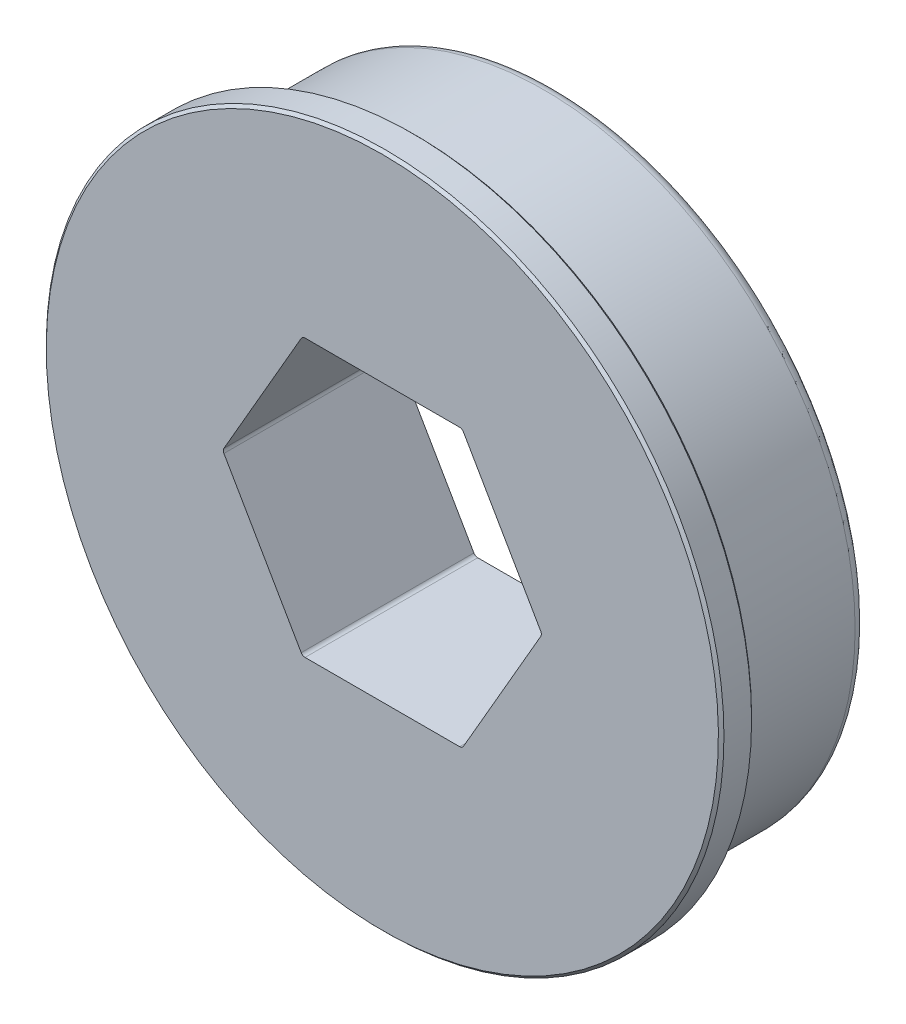
ISO-10303-21;
HEADER;
FILE_DESCRIPTION(('STEP AP214'),'2;1');
FILE_NAME('part.step','',(''),(''),'','','');
FILE_SCHEMA(('AUTOMOTIVE_DESIGN { 1 0 10303 214 1 1 1 1 }'));
ENDSEC;
DATA;
#1=APPLICATION_CONTEXT('core data for automotive mechanical design processes');
#2=APPLICATION_PROTOCOL_DEFINITION('international standard','automotive_design',2000,#1);
#3=PRODUCT_CONTEXT('',#1,'mechanical');
#4=PRODUCT('Part','Part','',(#3));
#5=PRODUCT_RELATED_PRODUCT_CATEGORY('part','',(#4));
#6=PRODUCT_DEFINITION_FORMATION('','',#4);
#7=PRODUCT_DEFINITION_CONTEXT('part definition',#1,'design');
#8=PRODUCT_DEFINITION('design','',#6,#7);
#9=PRODUCT_DEFINITION_SHAPE('','',#8);
#10=(LENGTH_UNIT() NAMED_UNIT(*) SI_UNIT(.MILLI.,.METRE.));
#11=(NAMED_UNIT(*) PLANE_ANGLE_UNIT() SI_UNIT($,.RADIAN.));
#12=(NAMED_UNIT(*) SI_UNIT($,.STERADIAN.) SOLID_ANGLE_UNIT());
#13=UNCERTAINTY_MEASURE_WITH_UNIT(LENGTH_MEASURE(1.E-05),#10,'distance_accuracy_value','');
#14=(GEOMETRIC_REPRESENTATION_CONTEXT(3) GLOBAL_UNCERTAINTY_ASSIGNED_CONTEXT((#13)) GLOBAL_UNIT_ASSIGNED_CONTEXT((#10,
#11,#12)) REPRESENTATION_CONTEXT('',''));
#15=CARTESIAN_POINT('',(0.,0.,0.));
#16=DIRECTION('',(0.,0.,1.));
#17=DIRECTION('',(1.,0.,0.));
#18=AXIS2_PLACEMENT_3D('',#15,#16,#17);
#19=CARTESIAN_POINT('',(0.,0.,7.92734));
#20=DIRECTION('',(0.,0.,-1.));
#21=DIRECTION('',(-1.,0.,0.));
#22=AXIS2_PLACEMENT_3D('',#19,#20,#21);
#23=CYLINDRICAL_SURFACE('',#22,13.97);
#24=CARTESIAN_POINT('',(0.,0.,5.89534000034));
#25=DIRECTION('',(0.,0.,-1.));
#26=DIRECTION('',(-1.,0.,0.));
#27=AXIS2_PLACEMENT_3D('',#24,#25,#26);
#28=CIRCLE('',#27,13.97);
#29=CARTESIAN_POINT('',(-13.97,0.,5.89534000034));
#30=VERTEX_POINT('',#29);
#31=EDGE_CURVE('E255',#30,#30,#28,.T.);
#32=ORIENTED_EDGE('',*,*,#31,.F.);
#33=EDGE_LOOP('',(#32));
#34=FACE_BOUND('',#33,.T.);
#35=CARTESIAN_POINT('',(0.,0.,6.40333999979));
#36=DIRECTION('',(0.,0.,-1.));
#37=DIRECTION('',(-1.,0.,0.));
#38=AXIS2_PLACEMENT_3D('',#35,#36,#37);
#39=CIRCLE('',#38,13.97);
#40=CARTESIAN_POINT('',(-13.97,0.,6.40333999979));
#41=VERTEX_POINT('',#40);
#42=EDGE_CURVE('E252',#41,#41,#39,.F.);
#43=ORIENTED_EDGE('',*,*,#42,.F.);
#44=EDGE_LOOP('',(#43));
#45=FACE_BOUND('',#44,.T.);
#46=ADVANCED_FACE('F17',(#34,#45),#23,.T.);
#47=CARTESIAN_POINT('',(14.2875,0.,5.89534));
#48=DIRECTION('',(0.,0.,1.));
#49=DIRECTION('',(1.,0.,0.));
#50=AXIS2_PLACEMENT_3D('',#47,#48,#49);
#51=PLANE('',#50);
#52=ORIENTED_EDGE('',*,*,#31,.T.);
#53=EDGE_LOOP('',(#52));
#54=FACE_BOUND('',#53,.T.);
#55=CARTESIAN_POINT('',(0.,0.,5.89534000034));
#56=DIRECTION('',(0.,0.,-1.));
#57=DIRECTION('',(-1.,0.,0.));
#58=AXIS2_PLACEMENT_3D('',#55,#56,#57);
#59=CIRCLE('',#58,14.2875);
#60=CARTESIAN_POINT('',(-14.2875,0.,5.89534000034));
#61=VERTEX_POINT('',#60);
#62=EDGE_CURVE('E249',#61,#61,#59,.T.);
#63=ORIENTED_EDGE('',*,*,#62,.F.);
#64=EDGE_LOOP('',(#63));
#65=FACE_BOUND('',#64,.T.);
#66=ADVANCED_FACE('F378',(#54,#65),#51,.T.);
#67=CARTESIAN_POINT('',(13.97,0.,6.40334));
#68=DIRECTION('',(0.,0.,-1.));
#69=DIRECTION('',(-1.,0.,0.));
#70=AXIS2_PLACEMENT_3D('',#67,#68,#69);
#71=PLANE('',#70);
#72=ORIENTED_EDGE('',*,*,#42,.T.);
#73=EDGE_LOOP('',(#72));
#74=FACE_BOUND('',#73,.T.);
#75=CARTESIAN_POINT('',(0.,0.,6.40333999975));
#76=DIRECTION('',(0.,0.,1.));
#77=DIRECTION('',(1.,0.,0.));
#78=AXIS2_PLACEMENT_3D('',#75,#76,#77);
#79=CIRCLE('',#78,15.43049999975);
#80=CARTESIAN_POINT('',(15.43049999975,0.,6.40333999975));
#81=VERTEX_POINT('',#80);
#82=EDGE_CURVE('E220',#81,#81,#79,.T.);
#83=ORIENTED_EDGE('',*,*,#82,.F.);
#84=EDGE_LOOP('',(#83));
#85=FACE_BOUND('',#84,.T.);
#86=ADVANCED_FACE('F373',(#74,#85),#71,.T.);
#87=CARTESIAN_POINT('',(0.,0.,7.92734));
#88=DIRECTION('',(0.,0.,-1.));
#89=DIRECTION('',(-1.,0.,0.));
#90=AXIS2_PLACEMENT_3D('',#87,#88,#89);
#91=CYLINDRICAL_SURFACE('',#90,14.2875);
#92=ORIENTED_EDGE('',*,*,#62,.T.);
#93=EDGE_LOOP('',(#92));
#94=FACE_BOUND('',#93,.T.);
#95=CARTESIAN_POINT('',(0.,0.,0.508));
#96=DIRECTION('',(0.,0.,-1.));
#97=DIRECTION('',(1.,0.,0.));
#98=AXIS2_PLACEMENT_3D('',#95,#96,#97);
#99=CIRCLE('',#98,14.2875);
#100=CARTESIAN_POINT('',(14.2875,0.,0.508));
#101=VERTEX_POINT('',#100);
#102=EDGE_CURVE('E218',#101,#101,#99,.T.);
#103=ORIENTED_EDGE('',*,*,#102,.F.);
#104=EDGE_LOOP('',(#103));
#105=FACE_BOUND('',#104,.T.);
#106=ADVANCED_FACE('F368',(#94,#105),#91,.T.);
#107=CARTESIAN_POINT('',(0.,0.,6.53034000006006));
#108=DIRECTION('',(0.,0.,1.));
#109=DIRECTION('',(1.,0.,0.));
#110=AXIS2_PLACEMENT_3D('',#107,#108,#109);
#111=CONICAL_SURFACE('',#110,15.5575000000599,0.785398163396998);
#112=ORIENTED_EDGE('',*,*,#82,.T.);
#113=EDGE_LOOP('',(#112));
#114=FACE_BOUND('',#113,.T.);
#115=CARTESIAN_POINT('',(0.,0.,6.53034000012));
#116=DIRECTION('',(0.,0.,-1.));
#117=DIRECTION('',(-1.,0.,0.));
#118=AXIS2_PLACEMENT_3D('',#115,#116,#117);
#119=CIRCLE('',#118,15.5575);
#120=CARTESIAN_POINT('',(-15.5575,0.,6.53034000012));
#121=VERTEX_POINT('',#120);
#122=EDGE_CURVE('E86',#121,#121,#119,.F.);
#123=ORIENTED_EDGE('',*,*,#122,.F.);
#124=EDGE_LOOP('',(#123));
#125=FACE_BOUND('',#124,.T.);
#126=ADVANCED_FACE('F203',(#114,#125),#111,.T.);
#127=CARTESIAN_POINT('',(0.,0.,0.508));
#128=DIRECTION('',(0.,0.,-1.));
#129=DIRECTION('',(1.,0.,0.));
#130=AXIS2_PLACEMENT_3D('',#127,#128,#129);
#131=TOROIDAL_SURFACE('',#130,13.7795,0.508);
#132=CARTESIAN_POINT('',(0.,0.,0.));
#133=DIRECTION('',(0.,0.,1.));
#134=DIRECTION('',(1.,0.,0.));
#135=AXIS2_PLACEMENT_3D('',#132,#133,#134);
#136=CIRCLE('',#135,13.7795000002);
#137=CARTESIAN_POINT('',(-13.77950000014,0.,0.));
#138=VERTEX_POINT('',#137);
#139=CARTESIAN_POINT('',(13.77950000014,0.,0.));
#140=VERTEX_POINT('',#139);
#141=EDGE_CURVE('E151',#138,#140,#136,.F.);
#142=ORIENTED_EDGE('',*,*,#141,.F.);
#143=CARTESIAN_POINT('',(0.,0.,0.));
#144=DIRECTION('',(0.,0.,1.));
#145=DIRECTION('',(-1.,0.,0.));
#146=AXIS2_PLACEMENT_3D('',#143,#144,#145);
#147=CIRCLE('',#146,13.7795000001);
#148=EDGE_CURVE('E240',#140,#138,#147,.F.);
#149=ORIENTED_EDGE('',*,*,#148,.F.);
#150=EDGE_LOOP('',(#142,#149));
#151=FACE_BOUND('',#150,.T.);
#152=ORIENTED_EDGE('',*,*,#102,.T.);
#153=EDGE_LOOP('',(#152));
#154=FACE_BOUND('',#153,.T.);
#155=ADVANCED_FACE('F197',(#151,#154),#131,.T.);
#156=CARTESIAN_POINT('',(0.,0.,7.92734));
#157=DIRECTION('',(0.,0.,-1.));
#158=DIRECTION('',(-1.,0.,0.));
#159=AXIS2_PLACEMENT_3D('',#156,#157,#158);
#160=CYLINDRICAL_SURFACE('',#159,15.5575);
#161=ORIENTED_EDGE('',*,*,#122,.T.);
#162=EDGE_LOOP('',(#161));
#163=FACE_BOUND('',#162,.T.);
#164=CARTESIAN_POINT('',(0.,0.,7.800339999835));
#165=DIRECTION('',(0.,0.,-1.));
#166=DIRECTION('',(1.,0.,0.));
#167=AXIS2_PLACEMENT_3D('',#164,#165,#166);
#168=CIRCLE('',#167,15.557500000165);
#169=CARTESIAN_POINT('',(15.557500000165,0.,7.800339999835));
#170=VERTEX_POINT('',#169);
#171=EDGE_CURVE('E96',#170,#170,#168,.F.);
#172=ORIENTED_EDGE('',*,*,#171,.F.);
#173=EDGE_LOOP('',(#172));
#174=FACE_BOUND('',#173,.T.);
#175=ADVANCED_FACE('F202',(#163,#174),#160,.T.);
#176=CARTESIAN_POINT('',(-7.09771326931,0.,7.92734));
#177=DIRECTION('',(0.,0.,1.));
#178=DIRECTION('',(1.,0.,0.));
#179=AXIS2_PLACEMENT_3D('',#176,#177,#178);
#180=CYLINDRICAL_SURFACE('',#179,0.2032);
#181=DIRECTION('',(0.,0.,1.));
#182=VECTOR('',#181,1.);
#183=CARTESIAN_POINT('',(-7.27368963108776,0.10160000047205,7.92734));
#184=LINE('',#183,#182);
#185=CARTESIAN_POINT('',(-7.27368963122386,0.101600000236324,-4.33922862919101E-10));
#186=VERTEX_POINT('',#185);
#187=CARTESIAN_POINT('',(-7.27368963122185,0.101600000239414,7.92734));
#188=VERTEX_POINT('',#187);
#189=EDGE_CURVE('E83',#186,#188,#184,.T.);
#190=ORIENTED_EDGE('',*,*,#189,.T.);
#191=CARTESIAN_POINT('',(-7.09771326931,0.,7.92734));
#192=DIRECTION('',(0.,0.,1.));
#193=DIRECTION('',(1.,0.,0.));
#194=AXIS2_PLACEMENT_3D('',#191,#192,#193);
#195=CIRCLE('',#194,0.2032);
#196=CARTESIAN_POINT('',(-7.2736896309562,-0.10160000031221,7.92734));
#197=VERTEX_POINT('',#196);
#198=EDGE_CURVE('E72',#197,#188,#195,.F.);
#199=ORIENTED_EDGE('',*,*,#198,.F.);
#200=DIRECTION('',(0.,0.,1.));
#201=VECTOR('',#200,1.);
#202=CARTESIAN_POINT('',(-7.27368963087975,-0.101600000825381,7.92734));
#203=LINE('',#202,#201);
#204=CARTESIAN_POINT('',(-7.27368963111835,-0.101600000412125,0.));
#205=VERTEX_POINT('',#204);
#206=EDGE_CURVE('E80',#197,#205,#203,.F.);
#207=ORIENTED_EDGE('',*,*,#206,.T.);
#208=CARTESIAN_POINT('',(-7.09771326931,0.,0.));
#209=DIRECTION('',(0.,0.,1.));
#210=DIRECTION('',(1.,0.,0.));
#211=AXIS2_PLACEMENT_3D('',#208,#209,#210);
#212=CIRCLE('',#211,0.2032);
#213=EDGE_CURVE('E238',#186,#205,#212,.T.);
#214=ORIENTED_EDGE('',*,*,#213,.F.);
#215=EDGE_LOOP('',(#190,#199,#207,#214));
#216=FACE_BOUND('',#215,.T.);
#217=ADVANCED_FACE('F77',(#216),#180,.F.);
#218=CARTESIAN_POINT('',(-3.54885663465,6.1468,7.92734));
#219=DIRECTION('',(0.,0.,1.));
#220=DIRECTION('',(1.,0.,0.));
#221=AXIS2_PLACEMENT_3D('',#218,#219,#220);
#222=CYLINDRICAL_SURFACE('',#221,0.2032);
#223=DIRECTION('',(0.,0.,1.));
#224=VECTOR('',#223,1.);
#225=CARTESIAN_POINT('',(-3.72483299613289,6.24840000098869,7.92734));
#226=LINE('',#225,#224);
#227=CARTESIAN_POINT('',(-3.72483299630441,6.24840000043423,7.92734));
#228=VERTEX_POINT('',#227);
#229=CARTESIAN_POINT('',(-3.7248329964177,6.24840000049538,-4.33922862919101E-10));
#230=VERTEX_POINT('',#229);
#231=EDGE_CURVE('E138',#228,#230,#226,.F.);
#232=ORIENTED_EDGE('',*,*,#231,.T.);
#233=CARTESIAN_POINT('',(-3.54885663465,6.1468,0.));
#234=DIRECTION('',(0.,0.,1.));
#235=DIRECTION('',(1.,0.,0.));
#236=AXIS2_PLACEMENT_3D('',#233,#234,#235);
#237=CIRCLE('',#236,0.2032);
#238=CARTESIAN_POINT('',(-3.54885663465,6.35,-4.33922862919101E-10));
#239=VERTEX_POINT('',#238);
#240=EDGE_CURVE('E226',#239,#230,#237,.T.);
#241=ORIENTED_EDGE('',*,*,#240,.F.);
#242=DIRECTION('',(0.,0.,1.));
#243=VECTOR('',#242,1.);
#244=CARTESIAN_POINT('',(-3.54885663465,6.35,7.92734));
#245=LINE('',#244,#243);
#246=CARTESIAN_POINT('',(-3.54885663465,6.35,7.92734));
#247=VERTEX_POINT('',#246);
#248=EDGE_CURVE('E130',#239,#247,#245,.T.);
#249=ORIENTED_EDGE('',*,*,#248,.T.);
#250=CARTESIAN_POINT('',(-3.54885663465,6.1468,7.92734));
#251=DIRECTION('',(0.,0.,1.));
#252=DIRECTION('',(1.,0.,0.));
#253=AXIS2_PLACEMENT_3D('',#250,#251,#252);
#254=CIRCLE('',#253,0.2032);
#255=EDGE_CURVE('E85',#228,#247,#254,.F.);
#256=ORIENTED_EDGE('',*,*,#255,.F.);
#257=EDGE_LOOP('',(#232,#241,#249,#256));
#258=FACE_BOUND('',#257,.T.);
#259=ADVANCED_FACE('F326',(#258),#222,.F.);
#260=CARTESIAN_POINT('',(3.54885663465,6.1468,7.92734));
#261=DIRECTION('',(0.,0.,1.));
#262=DIRECTION('',(1.,0.,0.));
#263=AXIS2_PLACEMENT_3D('',#260,#261,#262);
#264=CYLINDRICAL_SURFACE('',#263,0.2032);
#265=DIRECTION('',(0.,0.,1.));
#266=VECTOR('',#265,1.);
#267=CARTESIAN_POINT('',(3.54885663547,6.35,7.92734));
#268=LINE('',#267,#266);
#269=CARTESIAN_POINT('',(3.54885663506,6.35,7.92734));
#270=VERTEX_POINT('',#269);
#271=CARTESIAN_POINT('',(3.54885663506,6.35,-4.33922862919101E-10));
#272=VERTEX_POINT('',#271);
#273=EDGE_CURVE('E133',#270,#272,#268,.F.);
#274=ORIENTED_EDGE('',*,*,#273,.T.);
#275=CARTESIAN_POINT('',(3.54885663465,6.1468,0.));
#276=DIRECTION('',(0.,0.,1.));
#277=DIRECTION('',(1.,0.,0.));
#278=AXIS2_PLACEMENT_3D('',#275,#276,#277);
#279=CIRCLE('',#278,0.2032);
#280=CARTESIAN_POINT('',(3.72483299651719,6.24840000031611,-4.33922862919101E-10));
#281=VERTEX_POINT('',#280);
#282=EDGE_CURVE('E229',#281,#272,#279,.T.);
#283=ORIENTED_EDGE('',*,*,#282,.F.);
#284=DIRECTION('',(0.,0.,1.));
#285=VECTOR('',#284,1.);
#286=CARTESIAN_POINT('',(3.72483299633488,6.24840000063188,7.92734));
#287=LINE('',#286,#285);
#288=CARTESIAN_POINT('',(3.72483299650992,6.24840000032909,7.92734));
#289=VERTEX_POINT('',#288);
#290=EDGE_CURVE('E122',#281,#289,#287,.T.);
#291=ORIENTED_EDGE('',*,*,#290,.T.);
#292=CARTESIAN_POINT('',(3.54885663465,6.1468,7.92734));
#293=DIRECTION('',(0.,0.,1.));
#294=DIRECTION('',(1.,0.,0.));
#295=AXIS2_PLACEMENT_3D('',#292,#293,#294);
#296=CIRCLE('',#295,0.2032);
#297=EDGE_CURVE('E244',#270,#289,#296,.F.);
#298=ORIENTED_EDGE('',*,*,#297,.F.);
#299=EDGE_LOOP('',(#274,#283,#291,#298));
#300=FACE_BOUND('',#299,.T.);
#301=ADVANCED_FACE('F320',(#300),#264,.F.);
#302=CARTESIAN_POINT('',(7.09771326931,0.,7.92734));
#303=DIRECTION('',(0.,0.,1.));
#304=DIRECTION('',(1.,0.,0.));
#305=AXIS2_PLACEMENT_3D('',#302,#303,#304);
#306=CYLINDRICAL_SURFACE('',#305,0.2032);
#307=DIRECTION('',(0.,0.,1.));
#308=VECTOR('',#307,1.);
#309=CARTESIAN_POINT('',(7.27368963108777,-0.101600000472052,7.92734));
#310=LINE('',#309,#308);
#311=CARTESIAN_POINT('',(7.27368963122386,-0.101600000236331,-4.33922862919101E-10));
#312=VERTEX_POINT('',#311);
#313=CARTESIAN_POINT('',(7.27368963123207,-0.101600000221845,7.92734));
#314=VERTEX_POINT('',#313);
#315=EDGE_CURVE('E115',#312,#314,#310,.T.);
#316=ORIENTED_EDGE('',*,*,#315,.T.);
#317=CARTESIAN_POINT('',(7.09771326931,0.,7.92734));
#318=DIRECTION('',(0.,0.,1.));
#319=DIRECTION('',(1.,0.,0.));
#320=AXIS2_PLACEMENT_3D('',#317,#318,#319);
#321=CIRCLE('',#320,0.2032);
#322=CARTESIAN_POINT('',(7.27368963176603,0.101600000329813,7.92734));
#323=VERTEX_POINT('',#322);
#324=EDGE_CURVE('E242',#323,#314,#321,.F.);
#325=ORIENTED_EDGE('',*,*,#324,.F.);
#326=DIRECTION('',(0.,0.,1.));
#327=VECTOR('',#326,1.);
#328=CARTESIAN_POINT('',(7.27368963128975,0.10160000011524,7.92734));
#329=LINE('',#328,#327);
#330=CARTESIAN_POINT('',(7.27368963132335,0.10160000005705,-8.67845725838201E-10));
#331=VERTEX_POINT('',#330);
#332=EDGE_CURVE('E126',#323,#331,#329,.F.);
#333=ORIENTED_EDGE('',*,*,#332,.T.);
#334=CARTESIAN_POINT('',(7.09771326931,0.,-8.67845725838201E-10));
#335=DIRECTION('',(0.,0.,1.));
#336=DIRECTION('',(1.,0.,0.));
#337=AXIS2_PLACEMENT_3D('',#334,#335,#336);
#338=CIRCLE('',#337,0.2032);
#339=EDGE_CURVE('E232',#312,#331,#338,.T.);
#340=ORIENTED_EDGE('',*,*,#339,.F.);
#341=EDGE_LOOP('',(#316,#325,#333,#340));
#342=FACE_BOUND('',#341,.T.);
#343=ADVANCED_FACE('F302',(#342),#306,.F.);
#344=CARTESIAN_POINT('',(-3.54885663465,-6.1468,7.92734));
#345=DIRECTION('',(0.,0.,1.));
#346=DIRECTION('',(1.,0.,0.));
#347=AXIS2_PLACEMENT_3D('',#344,#345,#346);
#348=CYLINDRICAL_SURFACE('',#347,0.2032);
#349=DIRECTION('',(0.,0.,-1.));
#350=VECTOR('',#349,1.);
#351=CARTESIAN_POINT('',(-3.54885663383,-6.35,7.92734));
#352=LINE('',#351,#350);
#353=CARTESIAN_POINT('',(-3.54885663424,-6.35,7.92734));
#354=VERTEX_POINT('',#353);
#355=CARTESIAN_POINT('',(-3.54885663424,-6.35,-4.33922862919101E-10));
#356=VERTEX_POINT('',#355);
#357=EDGE_CURVE('E113',#354,#356,#352,.T.);
#358=ORIENTED_EDGE('',*,*,#357,.T.);
#359=CARTESIAN_POINT('',(-3.54885663465,-6.1468,0.));
#360=DIRECTION('',(0.,0.,1.));
#361=DIRECTION('',(1.,0.,0.));
#362=AXIS2_PLACEMENT_3D('',#359,#360,#361);
#363=CIRCLE('',#362,0.2032);
#364=CARTESIAN_POINT('',(-3.72483299651719,-6.24840000031611,0.));
#365=VERTEX_POINT('',#364);
#366=EDGE_CURVE('E235',#365,#356,#363,.T.);
#367=ORIENTED_EDGE('',*,*,#366,.F.);
#368=DIRECTION('',(0.,0.,1.));
#369=VECTOR('',#368,1.);
#370=CARTESIAN_POINT('',(-3.72483299633488,-6.24840000063188,7.92734));
#371=LINE('',#370,#369);
#372=CARTESIAN_POINT('',(-3.72483299652009,-6.24840000031148,7.92734));
#373=VERTEX_POINT('',#372);
#374=EDGE_CURVE('E141',#365,#373,#371,.T.);
#375=ORIENTED_EDGE('',*,*,#374,.T.);
#376=CARTESIAN_POINT('',(-3.54885663465,-6.1468,7.92734));
#377=DIRECTION('',(0.,0.,1.));
#378=DIRECTION('',(1.,0.,0.));
#379=AXIS2_PLACEMENT_3D('',#376,#377,#378);
#380=CIRCLE('',#379,0.2032);
#381=EDGE_CURVE('E37',#354,#373,#380,.F.);
#382=ORIENTED_EDGE('',*,*,#381,.F.);
#383=EDGE_LOOP('',(#358,#367,#375,#382));
#384=FACE_BOUND('',#383,.T.);
#385=ADVANCED_FACE('F168',(#384),#348,.F.);
#386=CARTESIAN_POINT('',(0.,0.,0.));
#387=DIRECTION('',(0.,0.,-1.));
#388=DIRECTION('',(-1.,0.,0.));
#389=AXIS2_PLACEMENT_3D('',#386,#387,#388);
#390=PLANE('',#389);
#391=DIRECTION('',(-1.,0.,0.));
#392=VECTOR('',#391,1.);
#393=CARTESIAN_POINT('',(-3.66617420935,6.35,-8.67845725838201E-10));
#394=LINE('',#393,#392);
#395=EDGE_CURVE('E129',#272,#239,#394,.T.);
#396=ORIENTED_EDGE('',*,*,#395,.T.);
#397=ORIENTED_EDGE('',*,*,#240,.T.);
#398=DIRECTION('',(-0.50000000000019,-0.866025403784329,0.));
#399=VECTOR('',#398,1.);
#400=CARTESIAN_POINT('',(-7.33234841871,0.,-8.67845725838201E-10));
#401=LINE('',#400,#399);
#402=EDGE_CURVE('E137',#230,#186,#401,.T.);
#403=ORIENTED_EDGE('',*,*,#402,.T.);
#404=ORIENTED_EDGE('',*,*,#213,.T.);
#405=DIRECTION('',(0.50000000000019,-0.866025403784329,0.));
#406=VECTOR('',#405,1.);
#407=CARTESIAN_POINT('',(-3.66617420935,-6.35,0.));
#408=LINE('',#407,#406);
#409=EDGE_CURVE('E95',#205,#365,#408,.T.);
#410=ORIENTED_EDGE('',*,*,#409,.T.);
#411=ORIENTED_EDGE('',*,*,#366,.T.);
#412=DIRECTION('',(1.,0.,0.));
#413=VECTOR('',#412,1.);
#414=CARTESIAN_POINT('',(3.66617420935,-6.35,-8.67845725838201E-10));
#415=LINE('',#414,#413);
#416=CARTESIAN_POINT('',(3.54885663465,-6.35,-4.33922862919101E-10));
#417=VERTEX_POINT('',#416);
#418=EDGE_CURVE('E112',#356,#417,#415,.T.);
#419=ORIENTED_EDGE('',*,*,#418,.T.);
#420=CARTESIAN_POINT('',(3.54885663465,-6.1468,0.));
#421=DIRECTION('',(0.,0.,1.));
#422=DIRECTION('',(1.,0.,0.));
#423=AXIS2_PLACEMENT_3D('',#420,#421,#422);
#424=CIRCLE('',#423,0.2032);
#425=CARTESIAN_POINT('',(3.72483299662271,-6.24840000014032,-4.33922862919101E-10));
#426=VERTEX_POINT('',#425);
#427=EDGE_CURVE('E223',#417,#426,#424,.T.);
#428=ORIENTED_EDGE('',*,*,#427,.T.);
#429=DIRECTION('',(0.50000000000019,0.866025403784329,0.));
#430=VECTOR('',#429,1.);
#431=CARTESIAN_POINT('',(7.33234841871,0.,-8.67845725838201E-10));
#432=LINE('',#431,#430);
#433=EDGE_CURVE('E118',#426,#312,#432,.T.);
#434=ORIENTED_EDGE('',*,*,#433,.T.);
#435=ORIENTED_EDGE('',*,*,#339,.T.);
#436=DIRECTION('',(-0.50000000000019,0.866025403784329,0.));
#437=VECTOR('',#436,1.);
#438=CARTESIAN_POINT('',(3.66617420935,6.35,-8.67845725838201E-10));
#439=LINE('',#438,#437);
#440=EDGE_CURVE('E125',#331,#281,#439,.T.);
#441=ORIENTED_EDGE('',*,*,#440,.T.);
#442=ORIENTED_EDGE('',*,*,#282,.T.);
#443=EDGE_LOOP('',(#396,#397,#403,#404,#410,#411,#419,#428,#434,#435,#441,#442));
#444=FACE_BOUND('',#443,.T.);
#445=ORIENTED_EDGE('',*,*,#141,.T.);
#446=ORIENTED_EDGE('',*,*,#148,.T.);
#447=EDGE_LOOP('',(#445,#446));
#448=FACE_BOUND('',#447,.T.);
#449=ADVANCED_FACE('F157',(#444,#448),#390,.T.);
#450=CARTESIAN_POINT('',(3.54885663465,-6.1468,7.92734));
#451=DIRECTION('',(0.,0.,1.));
#452=DIRECTION('',(1.,0.,0.));
#453=AXIS2_PLACEMENT_3D('',#450,#451,#452);
#454=CYLINDRICAL_SURFACE('',#453,0.2032);
#455=DIRECTION('',(0.,0.,1.));
#456=VECTOR('',#455,1.);
#457=CARTESIAN_POINT('',(3.7248329965429,-6.24840000027855,7.92734));
#458=LINE('',#457,#456);
#459=CARTESIAN_POINT('',(3.72483299713458,-6.24840000041662,7.92734));
#460=VERTEX_POINT('',#459);
#461=EDGE_CURVE('E119',#460,#426,#458,.F.);
#462=ORIENTED_EDGE('',*,*,#461,.T.);
#463=ORIENTED_EDGE('',*,*,#427,.F.);
#464=DIRECTION('',(0.,0.,-1.));
#465=VECTOR('',#464,1.);
#466=CARTESIAN_POINT('',(3.54885663465,-6.35,7.92734));
#467=LINE('',#466,#465);
#468=CARTESIAN_POINT('',(3.54885663465,-6.35,7.92734));
#469=VERTEX_POINT('',#468);
#470=EDGE_CURVE('E106',#417,#469,#467,.F.);
#471=ORIENTED_EDGE('',*,*,#470,.T.);
#472=CARTESIAN_POINT('',(3.54885663465,-6.1468,7.92734));
#473=DIRECTION('',(0.,0.,1.));
#474=DIRECTION('',(1.,0.,0.));
#475=AXIS2_PLACEMENT_3D('',#472,#473,#474);
#476=CIRCLE('',#475,0.2032);
#477=EDGE_CURVE('E192',#460,#469,#476,.F.);
#478=ORIENTED_EDGE('',*,*,#477,.F.);
#479=EDGE_LOOP('',(#462,#463,#471,#478));
#480=FACE_BOUND('',#479,.T.);
#481=ADVANCED_FACE('F167',(#480),#454,.F.);
#482=CARTESIAN_POINT('',(0.,0.,7.800339999835));
#483=DIRECTION('',(0.,0.,-1.));
#484=DIRECTION('',(-1.,0.,0.));
#485=AXIS2_PLACEMENT_3D('',#482,#483,#484);
#486=CONICAL_SURFACE('',#485,15.557500000165,0.785398163396998);
#487=CARTESIAN_POINT('',(0.,0.,7.92734000005006));
#488=DIRECTION('',(0.,0.,-1.));
#489=DIRECTION('',(0.,1.,0.));
#490=AXIS2_PLACEMENT_3D('',#487,#488,#489);
#491=CIRCLE('',#490,15.4304999999501);
#492=CARTESIAN_POINT('',(0.,15.4304999999501,7.92734000005006));
#493=VERTEX_POINT('',#492);
#494=EDGE_CURVE('E101',#493,#493,#491,.F.);
#495=ORIENTED_EDGE('',*,*,#494,.F.);
#496=EDGE_LOOP('',(#495));
#497=FACE_BOUND('',#496,.T.);
#498=ORIENTED_EDGE('',*,*,#171,.T.);
#499=EDGE_LOOP('',(#498));
#500=FACE_BOUND('',#499,.T.);
#501=ADVANCED_FACE('F351',(#497,#500),#486,.T.);
#502=CARTESIAN_POINT('',(-3.66617420935,-6.35,7.92734));
#503=DIRECTION('',(-0.866025403784329,-0.50000000000019,0.));
#504=DIRECTION('',(0.50000000000019,-0.866025403784329,0.));
#505=AXIS2_PLACEMENT_3D('',#502,#503,#504);
#506=PLANE('',#505);
#507=ORIENTED_EDGE('',*,*,#374,.F.);
#508=ORIENTED_EDGE('',*,*,#409,.F.);
#509=ORIENTED_EDGE('',*,*,#206,.F.);
#510=DIRECTION('',(-0.499999999953699,0.866025403811171,0.));
#511=VECTOR('',#510,1.);
#512=CARTESIAN_POINT('',(-3.7248329967,-6.2484,7.92734));
#513=LINE('',#512,#511);
#514=EDGE_CURVE('E93',#373,#197,#513,.T.);
#515=ORIENTED_EDGE('',*,*,#514,.F.);
#516=EDGE_LOOP('',(#507,#508,#509,#515));
#517=FACE_BOUND('',#516,.T.);
#518=ADVANCED_FACE('F92',(#517),#506,.F.);
#519=CARTESIAN_POINT('',(-7.33234841871,0.,7.92734));
#520=DIRECTION('',(-0.866025403784329,0.50000000000019,0.));
#521=DIRECTION('',(-0.50000000000019,-0.866025403784329,0.));
#522=AXIS2_PLACEMENT_3D('',#519,#520,#521);
#523=PLANE('',#522);
#524=ORIENTED_EDGE('',*,*,#189,.F.);
#525=ORIENTED_EDGE('',*,*,#402,.F.);
#526=ORIENTED_EDGE('',*,*,#231,.F.);
#527=DIRECTION('',(0.500000000031562,0.866025403766217,0.));
#528=VECTOR('',#527,1.);
#529=CARTESIAN_POINT('',(-7.27368963136,0.1016,7.92734));
#530=LINE('',#529,#528);
#531=EDGE_CURVE('E100',#188,#228,#530,.T.);
#532=ORIENTED_EDGE('',*,*,#531,.F.);
#533=EDGE_LOOP('',(#524,#525,#526,#532));
#534=FACE_BOUND('',#533,.T.);
#535=ADVANCED_FACE('F325',(#534),#523,.F.);
#536=CARTESIAN_POINT('',(-3.66617420935,6.35,7.92734));
#537=DIRECTION('',(0.,1.,0.));
#538=DIRECTION('',(-1.,0.,0.));
#539=AXIS2_PLACEMENT_3D('',#536,#537,#538);
#540=PLANE('',#539);
#541=ORIENTED_EDGE('',*,*,#273,.F.);
#542=DIRECTION('',(1.,0.,0.));
#543=VECTOR('',#542,1.);
#544=CARTESIAN_POINT('',(15.5575,6.35,7.92734));
#545=LINE('',#544,#543);
#546=EDGE_CURVE('E103',#247,#270,#545,.T.);
#547=ORIENTED_EDGE('',*,*,#546,.F.);
#548=ORIENTED_EDGE('',*,*,#248,.F.);
#549=ORIENTED_EDGE('',*,*,#395,.F.);
#550=EDGE_LOOP('',(#541,#547,#548,#549));
#551=FACE_BOUND('',#550,.T.);
#552=ADVANCED_FACE('F317',(#551),#540,.F.);
#553=CARTESIAN_POINT('',(3.66617420935,6.35,7.92734));
#554=DIRECTION('',(0.866025403784329,0.50000000000019,0.));
#555=DIRECTION('',(-0.50000000000019,0.866025403784329,0.));
#556=AXIS2_PLACEMENT_3D('',#553,#554,#555);
#557=PLANE('',#556);
#558=ORIENTED_EDGE('',*,*,#290,.F.);
#559=ORIENTED_EDGE('',*,*,#440,.F.);
#560=ORIENTED_EDGE('',*,*,#332,.F.);
#561=DIRECTION('',(0.500000000126994,-0.866025403711118,0.));
#562=VECTOR('',#561,1.);
#563=CARTESIAN_POINT('',(3.7248329967,6.2484,7.92734));
#564=LINE('',#563,#562);
#565=EDGE_CURVE('E309',#289,#323,#564,.T.);
#566=ORIENTED_EDGE('',*,*,#565,.F.);
#567=EDGE_LOOP('',(#558,#559,#560,#566));
#568=FACE_BOUND('',#567,.T.);
#569=ADVANCED_FACE('F308',(#568),#557,.F.);
#570=CARTESIAN_POINT('',(7.33234841871,0.,7.92734));
#571=DIRECTION('',(0.866025403784329,-0.50000000000019,0.));
#572=DIRECTION('',(0.50000000000019,0.866025403784329,0.));
#573=AXIS2_PLACEMENT_3D('',#570,#571,#572);
#574=PLANE('',#573);
#575=ORIENTED_EDGE('',*,*,#315,.F.);
#576=ORIENTED_EDGE('',*,*,#433,.F.);
#577=ORIENTED_EDGE('',*,*,#461,.F.);
#578=DIRECTION('',(-0.499999999858266,-0.866025403866269,0.));
#579=VECTOR('',#578,1.);
#580=CARTESIAN_POINT('',(7.27368963136,-0.1016,7.92734));
#581=LINE('',#580,#579);
#582=EDGE_CURVE('E28',#314,#460,#581,.T.);
#583=ORIENTED_EDGE('',*,*,#582,.F.);
#584=EDGE_LOOP('',(#575,#576,#577,#583));
#585=FACE_BOUND('',#584,.T.);
#586=ADVANCED_FACE('F299',(#585),#574,.F.);
#587=CARTESIAN_POINT('',(3.66617420935,-6.35,7.92734));
#588=DIRECTION('',(0.,-1.,0.));
#589=DIRECTION('',(0.,0.,-1.));
#590=AXIS2_PLACEMENT_3D('',#587,#588,#589);
#591=PLANE('',#590);
#592=ORIENTED_EDGE('',*,*,#470,.F.);
#593=ORIENTED_EDGE('',*,*,#418,.F.);
#594=ORIENTED_EDGE('',*,*,#357,.F.);
#595=DIRECTION('',(1.,0.,0.));
#596=VECTOR('',#595,1.);
#597=CARTESIAN_POINT('',(15.5575,-6.35,7.92734));
#598=LINE('',#597,#596);
#599=EDGE_CURVE('E11',#469,#354,#598,.F.);
#600=ORIENTED_EDGE('',*,*,#599,.F.);
#601=EDGE_LOOP('',(#592,#593,#594,#600));
#602=FACE_BOUND('',#601,.T.);
#603=ADVANCED_FACE('F291',(#602),#591,.F.);
#604=CARTESIAN_POINT('',(15.5575,0.,7.92734));
#605=DIRECTION('',(0.,0.,1.));
#606=DIRECTION('',(1.,0.,0.));
#607=AXIS2_PLACEMENT_3D('',#604,#605,#606);
#608=PLANE('',#607);
#609=ORIENTED_EDGE('',*,*,#599,.T.);
#610=ORIENTED_EDGE('',*,*,#381,.T.);
#611=ORIENTED_EDGE('',*,*,#514,.T.);
#612=ORIENTED_EDGE('',*,*,#198,.T.);
#613=ORIENTED_EDGE('',*,*,#531,.T.);
#614=ORIENTED_EDGE('',*,*,#255,.T.);
#615=ORIENTED_EDGE('',*,*,#546,.T.);
#616=ORIENTED_EDGE('',*,*,#297,.T.);
#617=ORIENTED_EDGE('',*,*,#565,.T.);
#618=ORIENTED_EDGE('',*,*,#324,.T.);
#619=ORIENTED_EDGE('',*,*,#582,.T.);
#620=ORIENTED_EDGE('',*,*,#477,.T.);
#621=EDGE_LOOP('',(#609,#610,#611,#612,#613,#614,#615,#616,#617,#618,#619,#620));
#622=FACE_BOUND('',#621,.T.);
#623=ORIENTED_EDGE('',*,*,#494,.T.);
#624=EDGE_LOOP('',(#623));
#625=FACE_BOUND('',#624,.T.);
#626=ADVANCED_FACE('F98',(#622,#625),#608,.T.);
#627=CLOSED_SHELL('',(#46,#66,#86,#106,#126,#155,#175,#217,#259,#301,#343,#385,#449,#481,#501,
#518,#535,#552,#569,#586,#603,#626));
#628=MANIFOLD_SOLID_BREP('B1',#627);
#629=ADVANCED_BREP_SHAPE_REPRESENTATION('',(#18,#628),#14);
#630=SHAPE_DEFINITION_REPRESENTATION(#9,#629);
ENDSEC;
END-ISO-10303-21;
